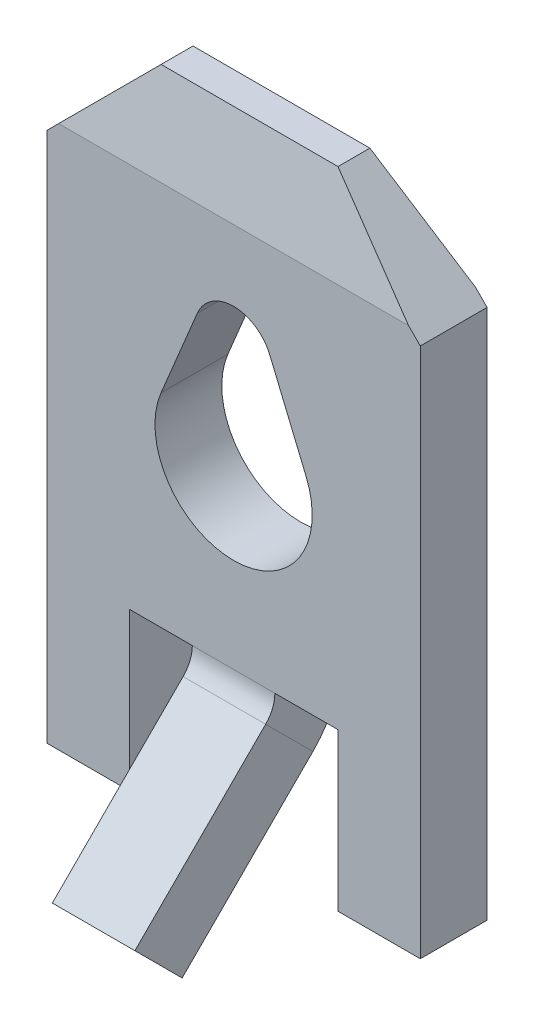
ISO-10303-21;
HEADER;
FILE_DESCRIPTION(('STEP AP214'),'2;1');
FILE_NAME('part.step','',(''),(''),'','','');
FILE_SCHEMA(('AUTOMOTIVE_DESIGN { 1 0 10303 214 1 1 1 1 }'));
ENDSEC;
DATA;
#1=APPLICATION_CONTEXT('core data for automotive mechanical design processes');
#2=APPLICATION_PROTOCOL_DEFINITION('international standard','automotive_design',2000,#1);
#3=PRODUCT_CONTEXT('',#1,'mechanical');
#4=PRODUCT('Part','Part','',(#3));
#5=PRODUCT_RELATED_PRODUCT_CATEGORY('part','',(#4));
#6=PRODUCT_DEFINITION_FORMATION('','',#4);
#7=PRODUCT_DEFINITION_CONTEXT('part definition',#1,'design');
#8=PRODUCT_DEFINITION('design','',#6,#7);
#9=PRODUCT_DEFINITION_SHAPE('','',#8);
#10=(LENGTH_UNIT() NAMED_UNIT(*) SI_UNIT(.MILLI.,.METRE.));
#11=(NAMED_UNIT(*) PLANE_ANGLE_UNIT() SI_UNIT($,.RADIAN.));
#12=(NAMED_UNIT(*) SI_UNIT($,.STERADIAN.) SOLID_ANGLE_UNIT());
#13=UNCERTAINTY_MEASURE_WITH_UNIT(LENGTH_MEASURE(1.E-05),#10,'distance_accuracy_value','');
#14=(GEOMETRIC_REPRESENTATION_CONTEXT(3) GLOBAL_UNCERTAINTY_ASSIGNED_CONTEXT((#13)) GLOBAL_UNIT_ASSIGNED_CONTEXT((#10,
#11,#12)) REPRESENTATION_CONTEXT('',''));
#15=CARTESIAN_POINT('',(0.,0.,0.));
#16=DIRECTION('',(0.,0.,1.));
#17=DIRECTION('',(1.,0.,0.));
#18=AXIS2_PLACEMENT_3D('',#15,#16,#17);
#19=CARTESIAN_POINT('',(4.75,0.149999999999999,0.));
#20=DIRECTION('',(0.,0.,1.));
#21=DIRECTION('',(0.,-1.,0.));
#22=AXIS2_PLACEMENT_3D('',#19,#20,#21);
#23=PLANE('',#22);
#24=DIRECTION('',(0.384813689288076,-0.922994271128754,0.));
#25=VECTOR('',#24,1.);
#26=CARTESIAN_POINT('',(2.84243697464802,5.82748992853653,0.));
#27=LINE('',#26,#25);
#28=CARTESIAN_POINT('',(2.84243697464802,5.82748992853653,0.));
#29=VERTEX_POINT('',#28);
#30=CARTESIAN_POINT('',(3.29799427112875,4.73481368928808,0.));
#31=VERTEX_POINT('',#30);
#32=EDGE_CURVE('E271',#29,#31,#27,.T.);
#33=ORIENTED_EDGE('',*,*,#32,.F.);
#34=CARTESIAN_POINT('',(2.375,5.65,0.));
#35=DIRECTION('',(0.,0.,1.));
#36=DIRECTION('',(0.,-1.,0.));
#37=AXIS2_PLACEMENT_3D('',#34,#35,#36);
#38=CIRCLE('',#37,0.5);
#39=CARTESIAN_POINT('',(1.91346153846154,5.84230769230769,0.));
#40=VERTEX_POINT('',#39);
#41=EDGE_CURVE('E274',#40,#29,#38,.F.);
#42=ORIENTED_EDGE('',*,*,#41,.F.);
#43=DIRECTION('',(0.384615384615385,0.923076923076923,0.));
#44=VECTOR('',#43,1.);
#45=CARTESIAN_POINT('',(1.91346153846154,5.84230769230769,0.));
#46=LINE('',#45,#44);
#47=CARTESIAN_POINT('',(1.45192307692308,4.73461538461538,0.));
#48=VERTEX_POINT('',#47);
#49=EDGE_CURVE('E276',#48,#40,#46,.T.);
#50=ORIENTED_EDGE('',*,*,#49,.F.);
#51=CARTESIAN_POINT('',(2.375,4.35,0.));
#52=DIRECTION('',(0.,0.,1.));
#53=DIRECTION('',(0.,-1.,0.));
#54=AXIS2_PLACEMENT_3D('',#51,#52,#53);
#55=CIRCLE('',#54,1.);
#56=EDGE_CURVE('E268',#31,#48,#55,.F.);
#57=ORIENTED_EDGE('',*,*,#56,.F.);
#58=EDGE_LOOP('',(#33,#42,#50,#57));
#59=FACE_BOUND('',#58,.T.);
#60=DIRECTION('',(1.,0.,0.));
#61=VECTOR('',#60,1.);
#62=CARTESIAN_POINT('',(2.9,2.15,0.));
#63=LINE('',#62,#61);
#64=CARTESIAN_POINT('',(2.9,2.15,0.));
#65=VERTEX_POINT('',#64);
#66=CARTESIAN_POINT('',(3.7,2.15,0.));
#67=VERTEX_POINT('',#66);
#68=EDGE_CURVE('E236',#65,#67,#63,.T.);
#69=ORIENTED_EDGE('',*,*,#68,.F.);
#70=DIRECTION('',(-1.,0.,0.));
#71=VECTOR('',#70,1.);
#72=CARTESIAN_POINT('',(4.75,2.15,0.));
#73=LINE('',#72,#71);
#74=CARTESIAN_POINT('',(1.85000000000001,2.15,0.));
#75=VERTEX_POINT('',#74);
#76=EDGE_CURVE('E49',#65,#75,#73,.T.);
#77=ORIENTED_EDGE('',*,*,#76,.T.);
#78=DIRECTION('',(1.,0.,0.));
#79=VECTOR('',#78,1.);
#80=CARTESIAN_POINT('',(1.85,2.15,0.));
#81=LINE('',#80,#79);
#82=CARTESIAN_POINT('',(1.05,2.15,0.));
#83=VERTEX_POINT('',#82);
#84=EDGE_CURVE('E247',#83,#75,#81,.T.);
#85=ORIENTED_EDGE('',*,*,#84,.F.);
#86=DIRECTION('',(0.,1.,0.));
#87=VECTOR('',#86,1.);
#88=CARTESIAN_POINT('',(1.05,2.15,0.));
#89=LINE('',#88,#87);
#90=CARTESIAN_POINT('',(1.05,0.149999999999999,0.));
#91=VERTEX_POINT('',#90);
#92=EDGE_CURVE('E245',#91,#83,#89,.T.);
#93=ORIENTED_EDGE('',*,*,#92,.F.);
#94=DIRECTION('',(-1.,0.,0.));
#95=VECTOR('',#94,1.);
#96=CARTESIAN_POINT('',(4.75,0.149999999999999,0.));
#97=LINE('',#96,#95);
#98=CARTESIAN_POINT('',(0.,0.149999999999999,0.));
#99=VERTEX_POINT('',#98);
#100=EDGE_CURVE('E345',#91,#99,#97,.T.);
#101=ORIENTED_EDGE('',*,*,#100,.T.);
#102=DIRECTION('',(0.,1.,0.));
#103=VECTOR('',#102,1.);
#104=CARTESIAN_POINT('',(0.,0.149999999999999,0.));
#105=LINE('',#104,#103);
#106=CARTESIAN_POINT('',(0.,6.9,0.));
#107=VERTEX_POINT('',#106);
#108=EDGE_CURVE('E330',#99,#107,#105,.T.);
#109=ORIENTED_EDGE('',*,*,#108,.T.);
#110=DIRECTION('',(-0.707106781186548,-0.707106781186548,0.));
#111=VECTOR('',#110,1.);
#112=CARTESIAN_POINT('',(0.,6.9,0.));
#113=LINE('',#112,#111);
#114=CARTESIAN_POINT('',(0.15,7.05,0.));
#115=VERTEX_POINT('',#114);
#116=EDGE_CURVE('E304',#115,#107,#113,.T.);
#117=ORIENTED_EDGE('',*,*,#116,.F.);
#118=DIRECTION('',(-1.,0.,0.));
#119=VECTOR('',#118,1.);
#120=CARTESIAN_POINT('',(4.75,7.05,0.));
#121=LINE('',#120,#119);
#122=CARTESIAN_POINT('',(4.6,7.05,0.));
#123=VERTEX_POINT('',#122);
#124=EDGE_CURVE('E335',#123,#115,#121,.T.);
#125=ORIENTED_EDGE('',*,*,#124,.F.);
#126=DIRECTION('',(-0.707106781186548,0.707106781186548,0.));
#127=VECTOR('',#126,1.);
#128=CARTESIAN_POINT('',(3.5,8.15,0.));
#129=LINE('',#128,#127);
#130=CARTESIAN_POINT('',(4.75,6.9,0.));
#131=VERTEX_POINT('',#130);
#132=EDGE_CURVE('E300',#131,#123,#129,.T.);
#133=ORIENTED_EDGE('',*,*,#132,.F.);
#134=DIRECTION('',(0.,1.,0.));
#135=VECTOR('',#134,1.);
#136=CARTESIAN_POINT('',(4.75,0.149999999999999,0.));
#137=LINE('',#136,#135);
#138=CARTESIAN_POINT('',(4.75,0.149999999999999,0.));
#139=VERTEX_POINT('',#138);
#140=EDGE_CURVE('E332',#139,#131,#137,.T.);
#141=ORIENTED_EDGE('',*,*,#140,.F.);
#142=CARTESIAN_POINT('',(3.7,0.149999999999999,0.));
#143=VERTEX_POINT('',#142);
#144=EDGE_CURVE('E346',#139,#143,#97,.T.);
#145=ORIENTED_EDGE('',*,*,#144,.T.);
#146=DIRECTION('',(0.,-1.,0.));
#147=VECTOR('',#146,1.);
#148=CARTESIAN_POINT('',(3.7,2.15,0.));
#149=LINE('',#148,#147);
#150=EDGE_CURVE('E260',#67,#143,#149,.T.);
#151=ORIENTED_EDGE('',*,*,#150,.F.);
#152=EDGE_LOOP('',(#69,#77,#85,#93,#101,#109,#117,#125,#133,#141,#145,#151));
#153=FACE_BOUND('',#152,.T.);
#154=ADVANCED_FACE('F42',(#59,#153),#23,.F.);
#155=CARTESIAN_POINT('',(4.75,7.05,0.85));
#156=DIRECTION('',(0.,0.,-1.));
#157=DIRECTION('',(0.,1.,0.));
#158=AXIS2_PLACEMENT_3D('',#155,#156,#157);
#159=PLANE('',#158);
#160=DIRECTION('',(-0.384615384615385,-0.923076923076923,0.));
#161=VECTOR('',#160,1.);
#162=CARTESIAN_POINT('',(1.91346153846154,5.84230769230769,0.849999999999999));
#163=LINE('',#162,#161);
#164=CARTESIAN_POINT('',(1.91346153846154,5.84230769230769,0.85));
#165=VERTEX_POINT('',#164);
#166=CARTESIAN_POINT('',(1.45192307692308,4.73461538461538,0.849999999999999));
#167=VERTEX_POINT('',#166);
#168=EDGE_CURVE('E278',#165,#167,#163,.T.);
#169=ORIENTED_EDGE('',*,*,#168,.F.);
#170=CARTESIAN_POINT('',(2.375,5.65,0.849999999999999));
#171=DIRECTION('',(0.,0.,1.));
#172=DIRECTION('',(1.,0.,0.));
#173=AXIS2_PLACEMENT_3D('',#170,#171,#172);
#174=CIRCLE('',#173,0.5);
#175=CARTESIAN_POINT('',(2.84243697464802,5.82748992853653,0.849999999999999));
#176=VERTEX_POINT('',#175);
#177=EDGE_CURVE('E254',#176,#165,#174,.T.);
#178=ORIENTED_EDGE('',*,*,#177,.F.);
#179=DIRECTION('',(-0.384813689288076,0.922994271128754,0.));
#180=VECTOR('',#179,1.);
#181=CARTESIAN_POINT('',(2.84243697464802,5.82748992853653,0.849999999999999));
#182=LINE('',#181,#180);
#183=CARTESIAN_POINT('',(3.29799427112875,4.73481368928808,0.849999999999999));
#184=VERTEX_POINT('',#183);
#185=EDGE_CURVE('E284',#184,#176,#182,.T.);
#186=ORIENTED_EDGE('',*,*,#185,.F.);
#187=CARTESIAN_POINT('',(2.375,4.35,0.849999999999999));
#188=DIRECTION('',(0.,0.,1.));
#189=DIRECTION('',(1.,0.,0.));
#190=AXIS2_PLACEMENT_3D('',#187,#188,#189);
#191=CIRCLE('',#190,1.);
#192=EDGE_CURVE('E281',#167,#184,#191,.T.);
#193=ORIENTED_EDGE('',*,*,#192,.F.);
#194=EDGE_LOOP('',(#169,#178,#186,#193));
#195=FACE_BOUND('',#194,.T.);
#196=DIRECTION('',(-1.,0.,0.));
#197=VECTOR('',#196,1.);
#198=CARTESIAN_POINT('',(1.85,2.15,0.85));
#199=LINE('',#198,#197);
#200=CARTESIAN_POINT('',(1.85000000000001,2.15,0.849999999999999));
#201=VERTEX_POINT('',#200);
#202=CARTESIAN_POINT('',(1.05,2.15,0.85));
#203=VERTEX_POINT('',#202);
#204=EDGE_CURVE('E241',#201,#203,#199,.T.);
#205=ORIENTED_EDGE('',*,*,#204,.F.);
#206=DIRECTION('',(1.,0.,0.));
#207=VECTOR('',#206,1.);
#208=CARTESIAN_POINT('',(4.75,2.15,0.849999999999999));
#209=LINE('',#208,#207);
#210=CARTESIAN_POINT('',(2.9,2.15,0.849999999999999));
#211=VERTEX_POINT('',#210);
#212=EDGE_CURVE('E362',#201,#211,#209,.T.);
#213=ORIENTED_EDGE('',*,*,#212,.T.);
#214=DIRECTION('',(-1.,0.,0.));
#215=VECTOR('',#214,1.);
#216=CARTESIAN_POINT('',(2.9,2.15,0.85));
#217=LINE('',#216,#215);
#218=CARTESIAN_POINT('',(3.7,2.15,0.85));
#219=VERTEX_POINT('',#218);
#220=EDGE_CURVE('E248',#219,#211,#217,.T.);
#221=ORIENTED_EDGE('',*,*,#220,.F.);
#222=DIRECTION('',(0.,1.,0.));
#223=VECTOR('',#222,1.);
#224=CARTESIAN_POINT('',(3.7,2.15,0.85));
#225=LINE('',#224,#223);
#226=CARTESIAN_POINT('',(3.7,0.149999999999999,0.849999999999999));
#227=VERTEX_POINT('',#226);
#228=EDGE_CURVE('E255',#227,#219,#225,.T.);
#229=ORIENTED_EDGE('',*,*,#228,.F.);
#230=DIRECTION('',(-1.,0.,0.));
#231=VECTOR('',#230,1.);
#232=CARTESIAN_POINT('',(4.75,0.149999999999999,0.849999999999999));
#233=LINE('',#232,#231);
#234=CARTESIAN_POINT('',(4.75,0.149999999999999,0.849999999999999));
#235=VERTEX_POINT('',#234);
#236=EDGE_CURVE('E350',#235,#227,#233,.T.);
#237=ORIENTED_EDGE('',*,*,#236,.F.);
#238=DIRECTION('',(0.,-1.,0.));
#239=VECTOR('',#238,1.);
#240=CARTESIAN_POINT('',(4.75,7.05,0.85));
#241=LINE('',#240,#239);
#242=CARTESIAN_POINT('',(4.75,6.9,0.85));
#243=VERTEX_POINT('',#242);
#244=EDGE_CURVE('E327',#243,#235,#241,.T.);
#245=ORIENTED_EDGE('',*,*,#244,.F.);
#246=DIRECTION('',(0.707106781186548,-0.707106781186548,0.));
#247=VECTOR('',#246,1.);
#248=CARTESIAN_POINT('',(3.5,8.15,0.849999999999999));
#249=LINE('',#248,#247);
#250=CARTESIAN_POINT('',(4.6,7.05,0.849999999999999));
#251=VERTEX_POINT('',#250);
#252=EDGE_CURVE('E296',#251,#243,#249,.T.);
#253=ORIENTED_EDGE('',*,*,#252,.F.);
#254=DIRECTION('',(-1.,0.,0.));
#255=VECTOR('',#254,1.);
#256=CARTESIAN_POINT('',(4.75,7.05,0.85));
#257=LINE('',#256,#255);
#258=CARTESIAN_POINT('',(0.15,7.05,0.849999999999999));
#259=VERTEX_POINT('',#258);
#260=EDGE_CURVE('E353',#251,#259,#257,.T.);
#261=ORIENTED_EDGE('',*,*,#260,.T.);
#262=DIRECTION('',(0.707106781186547,0.707106781186548,0.));
#263=VECTOR('',#262,1.);
#264=CARTESIAN_POINT('',(0.,6.9,0.849999999999999));
#265=LINE('',#264,#263);
#266=CARTESIAN_POINT('',(0.,6.9,0.849999999999999));
#267=VERTEX_POINT('',#266);
#268=EDGE_CURVE('E297',#267,#259,#265,.T.);
#269=ORIENTED_EDGE('',*,*,#268,.F.);
#270=DIRECTION('',(0.,-1.,0.));
#271=VECTOR('',#270,1.);
#272=CARTESIAN_POINT('',(0.,7.05,0.85));
#273=LINE('',#272,#271);
#274=CARTESIAN_POINT('',(0.,0.149999999999999,0.849999999999999));
#275=VERTEX_POINT('',#274);
#276=EDGE_CURVE('E326',#267,#275,#273,.T.);
#277=ORIENTED_EDGE('',*,*,#276,.T.);
#278=CARTESIAN_POINT('',(1.05,0.149999999999999,0.849999999999999));
#279=VERTEX_POINT('',#278);
#280=EDGE_CURVE('E349',#279,#275,#233,.T.);
#281=ORIENTED_EDGE('',*,*,#280,.F.);
#282=DIRECTION('',(0.,-1.,0.));
#283=VECTOR('',#282,1.);
#284=CARTESIAN_POINT('',(1.05,2.15,0.85));
#285=LINE('',#284,#283);
#286=EDGE_CURVE('E243',#203,#279,#285,.T.);
#287=ORIENTED_EDGE('',*,*,#286,.F.);
#288=EDGE_LOOP('',(#205,#213,#221,#229,#237,#245,#253,#261,#269,#277,#281,#287));
#289=FACE_BOUND('',#288,.T.);
#290=ADVANCED_FACE('F382',(#195,#289),#159,.F.);
#291=CARTESIAN_POINT('',(4.75,0.149999999999999,0.));
#292=DIRECTION('',(0.,1.,0.));
#293=DIRECTION('',(0.,0.,1.));
#294=AXIS2_PLACEMENT_3D('',#291,#292,#293);
#295=PLANE('',#294);
#296=ORIENTED_EDGE('',*,*,#100,.F.);
#297=DIRECTION('',(0.,0.,-1.));
#298=VECTOR('',#297,1.);
#299=CARTESIAN_POINT('',(1.05,0.149999999999999,3.0040659228538));
#300=LINE('',#299,#298);
#301=EDGE_CURVE('E63',#279,#91,#300,.T.);
#302=ORIENTED_EDGE('',*,*,#301,.F.);
#303=ORIENTED_EDGE('',*,*,#280,.T.);
#304=DIRECTION('',(0.,0.,-1.));
#305=VECTOR('',#304,1.);
#306=CARTESIAN_POINT('',(0.,0.149999999999999,0.));
#307=LINE('',#306,#305);
#308=EDGE_CURVE('E338',#275,#99,#307,.T.);
#309=ORIENTED_EDGE('',*,*,#308,.T.);
#310=EDGE_LOOP('',(#296,#302,#303,#309));
#311=FACE_BOUND('',#310,.T.);
#312=ADVANCED_FACE('F417',(#311),#295,.F.);
#313=CARTESIAN_POINT('',(4.75,7.05,0.));
#314=DIRECTION('',(0.,-0.214348018272916,0.976757353216485));
#315=DIRECTION('',(0.,-0.976757353216485,-0.214348018272916));
#316=AXIS2_PLACEMENT_3D('',#313,#314,#315);
#317=PLANE('',#316);
#318=ORIENTED_EDGE('',*,*,#124,.T.);
#319=DIRECTION('',(0.698744344369524,0.698744344369524,0.153338457091523));
#320=VECTOR('',#319,1.);
#321=CARTESIAN_POINT('',(2.39592083042662,9.29592083042662,0.492864146468432));
#322=LINE('',#321,#320);
#323=CARTESIAN_POINT('',(1.25,8.15,0.241393442622949));
#324=VERTEX_POINT('',#323);
#325=EDGE_CURVE('E317',#115,#324,#322,.T.);
#326=ORIENTED_EDGE('',*,*,#325,.T.);
#327=DIRECTION('',(-1.,0.,0.));
#328=VECTOR('',#327,1.);
#329=CARTESIAN_POINT('',(4.75,8.15,0.241393442622949));
#330=LINE('',#329,#328);
#331=CARTESIAN_POINT('',(3.5,8.15,0.241393442622949));
#332=VERTEX_POINT('',#331);
#333=EDGE_CURVE('E359',#332,#324,#330,.T.);
#334=ORIENTED_EDGE('',*,*,#333,.F.);
#335=DIRECTION('',(0.698744344369524,-0.698744344369524,-0.153338457091523));
#336=VECTOR('',#335,1.);
#337=CARTESIAN_POINT('',(4.67323654881826,6.97676345118174,-0.0160716569500576));
#338=LINE('',#337,#336);
#339=EDGE_CURVE('E323',#332,#123,#338,.T.);
#340=ORIENTED_EDGE('',*,*,#339,.T.);
#341=EDGE_LOOP('',(#318,#326,#334,#340));
#342=FACE_BOUND('',#341,.T.);
#343=ADVANCED_FACE('F479',(#342),#317,.F.);
#344=CARTESIAN_POINT('',(4.75,8.15,0.241393442622949));
#345=DIRECTION('',(0.,-1.,0.));
#346=DIRECTION('',(0.,0.,-1.));
#347=AXIS2_PLACEMENT_3D('',#344,#345,#346);
#348=PLANE('',#347);
#349=ORIENTED_EDGE('',*,*,#333,.T.);
#350=DIRECTION('',(0.,0.,1.));
#351=VECTOR('',#350,1.);
#352=CARTESIAN_POINT('',(1.25,8.15,-1.76776695296637));
#353=LINE('',#352,#351);
#354=CARTESIAN_POINT('',(1.25,8.15,0.647131147540979));
#355=VERTEX_POINT('',#354);
#356=EDGE_CURVE('E301',#324,#355,#353,.T.);
#357=ORIENTED_EDGE('',*,*,#356,.T.);
#358=DIRECTION('',(-1.,0.,0.));
#359=VECTOR('',#358,1.);
#360=CARTESIAN_POINT('',(4.75,8.15,0.647131147540979));
#361=LINE('',#360,#359);
#362=CARTESIAN_POINT('',(3.5,8.15,0.647131147540979));
#363=VERTEX_POINT('',#362);
#364=EDGE_CURVE('E356',#363,#355,#361,.T.);
#365=ORIENTED_EDGE('',*,*,#364,.F.);
#366=DIRECTION('',(0.,0.,1.));
#367=VECTOR('',#366,1.);
#368=CARTESIAN_POINT('',(3.5,8.15,-1.76776695296637));
#369=LINE('',#368,#367);
#370=EDGE_CURVE('E309',#332,#363,#369,.T.);
#371=ORIENTED_EDGE('',*,*,#370,.F.);
#372=EDGE_LOOP('',(#349,#357,#365,#371));
#373=FACE_BOUND('',#372,.T.);
#374=ADVANCED_FACE('F475',(#373),#348,.F.);
#375=CARTESIAN_POINT('',(4.75,8.15,0.647131147540979));
#376=DIRECTION('',(0.,-0.181367589437408,-0.983415373838371));
#377=DIRECTION('',(0.,0.983415373838371,-0.181367589437408));
#378=AXIS2_PLACEMENT_3D('',#375,#376,#377);
#379=PLANE('',#378);
#380=ORIENTED_EDGE('',*,*,#364,.T.);
#381=DIRECTION('',(-0.70116968993079,-0.70116968993079,0.12931408215937));
#382=VECTOR('',#381,1.);
#383=CARTESIAN_POINT('',(2.97073626927174,9.87073626927174,0.329782245421185));
#384=LINE('',#383,#382);
#385=EDGE_CURVE('E307',#355,#259,#384,.T.);
#386=ORIENTED_EDGE('',*,*,#385,.T.);
#387=ORIENTED_EDGE('',*,*,#260,.F.);
#388=DIRECTION('',(-0.70116968993079,0.70116968993079,-0.12931408215937));
#389=VECTOR('',#388,1.);
#390=CARTESIAN_POINT('',(4.11454866759705,7.53545133240295,0.760470041155192));
#391=LINE('',#390,#389);
#392=EDGE_CURVE('E320',#251,#363,#391,.T.);
#393=ORIENTED_EDGE('',*,*,#392,.T.);
#394=EDGE_LOOP('',(#380,#386,#387,#393));
#395=FACE_BOUND('',#394,.T.);
#396=ADVANCED_FACE('F471',(#395),#379,.F.);
#397=ORIENTED_EDGE('',*,*,#236,.T.);
#398=DIRECTION('',(0.,0.,-1.));
#399=VECTOR('',#398,1.);
#400=CARTESIAN_POINT('',(3.7,0.149999999999999,3.0040659228538));
#401=LINE('',#400,#399);
#402=EDGE_CURVE('E257',#227,#143,#401,.T.);
#403=ORIENTED_EDGE('',*,*,#402,.T.);
#404=ORIENTED_EDGE('',*,*,#144,.F.);
#405=DIRECTION('',(0.,0.,-1.));
#406=VECTOR('',#405,1.);
#407=CARTESIAN_POINT('',(4.75,0.149999999999999,0.));
#408=LINE('',#407,#406);
#409=EDGE_CURVE('E329',#235,#139,#408,.T.);
#410=ORIENTED_EDGE('',*,*,#409,.F.);
#411=EDGE_LOOP('',(#397,#403,#404,#410));
#412=FACE_BOUND('',#411,.T.);
#413=ADVANCED_FACE('F464',(#412),#295,.F.);
#414=CARTESIAN_POINT('',(4.75,0.,0.));
#415=DIRECTION('',(1.,0.,0.));
#416=DIRECTION('',(0.,0.,-1.));
#417=AXIS2_PLACEMENT_3D('',#414,#415,#416);
#418=PLANE('',#417);
#419=DIRECTION('',(0.,0.,1.));
#420=VECTOR('',#419,1.);
#421=CARTESIAN_POINT('',(4.75,6.9,-1.76776695296637));
#422=LINE('',#421,#420);
#423=EDGE_CURVE('E310',#131,#243,#422,.T.);
#424=ORIENTED_EDGE('',*,*,#423,.T.);
#425=ORIENTED_EDGE('',*,*,#244,.T.);
#426=ORIENTED_EDGE('',*,*,#409,.T.);
#427=ORIENTED_EDGE('',*,*,#140,.T.);
#428=EDGE_LOOP('',(#424,#425,#426,#427));
#429=FACE_BOUND('',#428,.T.);
#430=ADVANCED_FACE('F461',(#429),#418,.T.);
#431=CARTESIAN_POINT('',(0.,0.,0.));
#432=DIRECTION('',(1.,0.,0.));
#433=DIRECTION('',(0.,0.,-1.));
#434=AXIS2_PLACEMENT_3D('',#431,#432,#433);
#435=PLANE('',#434);
#436=ORIENTED_EDGE('',*,*,#276,.F.);
#437=DIRECTION('',(0.,0.,1.));
#438=VECTOR('',#437,1.);
#439=CARTESIAN_POINT('',(0.,6.9,-1.76776695296637));
#440=LINE('',#439,#438);
#441=EDGE_CURVE('E299',#107,#267,#440,.T.);
#442=ORIENTED_EDGE('',*,*,#441,.F.);
#443=ORIENTED_EDGE('',*,*,#108,.F.);
#444=ORIENTED_EDGE('',*,*,#308,.F.);
#445=EDGE_LOOP('',(#436,#442,#443,#444));
#446=FACE_BOUND('',#445,.T.);
#447=ADVANCED_FACE('F456',(#446),#435,.F.);
#448=CARTESIAN_POINT('',(0.,6.9,-1.76776695296637));
#449=DIRECTION('',(0.707106781186548,-0.707106781186548,0.));
#450=DIRECTION('',(0.707106781186548,0.707106781186548,0.));
#451=AXIS2_PLACEMENT_3D('',#448,#449,#450);
#452=PLANE('',#451);
#453=ORIENTED_EDGE('',*,*,#116,.T.);
#454=ORIENTED_EDGE('',*,*,#441,.T.);
#455=ORIENTED_EDGE('',*,*,#268,.T.);
#456=ORIENTED_EDGE('',*,*,#385,.F.);
#457=ORIENTED_EDGE('',*,*,#356,.F.);
#458=ORIENTED_EDGE('',*,*,#325,.F.);
#459=EDGE_LOOP('',(#453,#454,#455,#456,#457,#458));
#460=FACE_BOUND('',#459,.T.);
#461=ADVANCED_FACE('F453',(#460),#452,.F.);
#462=CARTESIAN_POINT('',(3.5,8.15,-1.76776695296637));
#463=DIRECTION('',(-0.707106781186547,-0.707106781186547,0.));
#464=DIRECTION('',(0.707106781186548,-0.707106781186548,0.));
#465=AXIS2_PLACEMENT_3D('',#462,#463,#464);
#466=PLANE('',#465);
#467=ORIENTED_EDGE('',*,*,#370,.T.);
#468=ORIENTED_EDGE('',*,*,#392,.F.);
#469=ORIENTED_EDGE('',*,*,#252,.T.);
#470=ORIENTED_EDGE('',*,*,#423,.F.);
#471=ORIENTED_EDGE('',*,*,#132,.T.);
#472=ORIENTED_EDGE('',*,*,#339,.F.);
#473=EDGE_LOOP('',(#467,#468,#469,#470,#471,#472));
#474=FACE_BOUND('',#473,.T.);
#475=ADVANCED_FACE('F452',(#474),#466,.F.);
#476=CARTESIAN_POINT('',(2.375,5.65,-3.44093010681705));
#477=DIRECTION('',(0.,0.,1.));
#478=DIRECTION('',(1.,0.,0.));
#479=AXIS2_PLACEMENT_3D('',#476,#477,#478);
#480=CYLINDRICAL_SURFACE('',#479,0.5);
#481=ORIENTED_EDGE('',*,*,#41,.T.);
#482=DIRECTION('',(0.,0.,1.));
#483=VECTOR('',#482,1.);
#484=CARTESIAN_POINT('',(2.84243697464802,5.82748992853653,-3.44093010681705));
#485=LINE('',#484,#483);
#486=EDGE_CURVE('E272',#29,#176,#485,.T.);
#487=ORIENTED_EDGE('',*,*,#486,.T.);
#488=ORIENTED_EDGE('',*,*,#177,.T.);
#489=DIRECTION('',(0.,0.,1.));
#490=VECTOR('',#489,1.);
#491=CARTESIAN_POINT('',(1.91346153846154,5.84230769230769,-3.44093010681705));
#492=LINE('',#491,#490);
#493=EDGE_CURVE('E287',#40,#165,#492,.T.);
#494=ORIENTED_EDGE('',*,*,#493,.F.);
#495=EDGE_LOOP('',(#481,#487,#488,#494));
#496=FACE_BOUND('',#495,.T.);
#497=ADVANCED_FACE('F435',(#496),#480,.F.);
#498=CARTESIAN_POINT('',(2.84243697464802,5.82748992853653,-3.44093010681705));
#499=DIRECTION('',(0.922994271128754,0.384813689288076,0.));
#500=DIRECTION('',(-0.384813689288076,0.922994271128754,0.));
#501=AXIS2_PLACEMENT_3D('',#498,#499,#500);
#502=PLANE('',#501);
#503=ORIENTED_EDGE('',*,*,#32,.T.);
#504=DIRECTION('',(0.,0.,1.));
#505=VECTOR('',#504,1.);
#506=CARTESIAN_POINT('',(3.29799427112875,4.73481368928808,-3.44093010681705));
#507=LINE('',#506,#505);
#508=EDGE_CURVE('E289',#31,#184,#507,.T.);
#509=ORIENTED_EDGE('',*,*,#508,.T.);
#510=ORIENTED_EDGE('',*,*,#185,.T.);
#511=ORIENTED_EDGE('',*,*,#486,.F.);
#512=EDGE_LOOP('',(#503,#509,#510,#511));
#513=FACE_BOUND('',#512,.T.);
#514=ADVANCED_FACE('F426',(#513),#502,.F.);
#515=CARTESIAN_POINT('',(2.375,4.35,-3.44093010681705));
#516=DIRECTION('',(0.,0.,1.));
#517=DIRECTION('',(1.,0.,0.));
#518=AXIS2_PLACEMENT_3D('',#515,#516,#517);
#519=CYLINDRICAL_SURFACE('',#518,1.);
#520=ORIENTED_EDGE('',*,*,#56,.T.);
#521=DIRECTION('',(0.,0.,1.));
#522=VECTOR('',#521,1.);
#523=CARTESIAN_POINT('',(1.45192307692308,4.73461538461538,-3.44093010681705));
#524=LINE('',#523,#522);
#525=EDGE_CURVE('E291',#48,#167,#524,.T.);
#526=ORIENTED_EDGE('',*,*,#525,.T.);
#527=ORIENTED_EDGE('',*,*,#192,.T.);
#528=ORIENTED_EDGE('',*,*,#508,.F.);
#529=EDGE_LOOP('',(#520,#526,#527,#528));
#530=FACE_BOUND('',#529,.T.);
#531=ADVANCED_FACE('F428',(#530),#519,.F.);
#532=CARTESIAN_POINT('',(1.91346153846154,5.84230769230769,-3.44093010681705));
#533=DIRECTION('',(-0.923076923076923,0.384615384615385,0.));
#534=DIRECTION('',(-0.384615384615385,-0.923076923076923,0.));
#535=AXIS2_PLACEMENT_3D('',#532,#533,#534);
#536=PLANE('',#535);
#537=ORIENTED_EDGE('',*,*,#49,.T.);
#538=ORIENTED_EDGE('',*,*,#493,.T.);
#539=ORIENTED_EDGE('',*,*,#168,.T.);
#540=ORIENTED_EDGE('',*,*,#525,.F.);
#541=EDGE_LOOP('',(#537,#538,#539,#540));
#542=FACE_BOUND('',#541,.T.);
#543=ADVANCED_FACE('F437',(#542),#536,.F.);
#544=CARTESIAN_POINT('',(3.7,2.15,3.0040659228538));
#545=DIRECTION('',(1.,0.,0.));
#546=DIRECTION('',(0.,1.,0.));
#547=AXIS2_PLACEMENT_3D('',#544,#545,#546);
#548=PLANE('',#547);
#549=ORIENTED_EDGE('',*,*,#228,.T.);
#550=DIRECTION('',(0.,0.,-1.));
#551=VECTOR('',#550,1.);
#552=CARTESIAN_POINT('',(3.7,2.15,3.0040659228538));
#553=LINE('',#552,#551);
#554=EDGE_CURVE('E262',#219,#67,#553,.T.);
#555=ORIENTED_EDGE('',*,*,#554,.T.);
#556=ORIENTED_EDGE('',*,*,#150,.T.);
#557=ORIENTED_EDGE('',*,*,#402,.F.);
#558=EDGE_LOOP('',(#549,#555,#556,#557));
#559=FACE_BOUND('',#558,.T.);
#560=ADVANCED_FACE('F439',(#559),#548,.F.);
#561=CARTESIAN_POINT('',(2.9,2.15,3.0040659228538));
#562=DIRECTION('',(0.,1.,0.));
#563=DIRECTION('',(-1.,0.,0.));
#564=AXIS2_PLACEMENT_3D('',#561,#562,#563);
#565=PLANE('',#564);
#566=ORIENTED_EDGE('',*,*,#220,.T.);
#567=DIRECTION('',(0.,0.,-1.));
#568=VECTOR('',#567,1.);
#569=CARTESIAN_POINT('',(2.9,2.15,3.0040659228538));
#570=LINE('',#569,#568);
#571=EDGE_CURVE('E12',#211,#65,#570,.T.);
#572=ORIENTED_EDGE('',*,*,#571,.T.);
#573=ORIENTED_EDGE('',*,*,#68,.T.);
#574=ORIENTED_EDGE('',*,*,#554,.F.);
#575=EDGE_LOOP('',(#566,#572,#573,#574));
#576=FACE_BOUND('',#575,.T.);
#577=ADVANCED_FACE('F372',(#576),#565,.F.);
#578=CARTESIAN_POINT('',(1.85,2.15,3.0040659228538));
#579=DIRECTION('',(0.,1.,0.));
#580=DIRECTION('',(0.,0.,1.));
#581=AXIS2_PLACEMENT_3D('',#578,#579,#580);
#582=PLANE('',#581);
#583=ORIENTED_EDGE('',*,*,#204,.T.);
#584=DIRECTION('',(0.,0.,-1.));
#585=VECTOR('',#584,1.);
#586=CARTESIAN_POINT('',(1.05,2.15,3.0040659228538));
#587=LINE('',#586,#585);
#588=EDGE_CURVE('E244',#203,#83,#587,.T.);
#589=ORIENTED_EDGE('',*,*,#588,.T.);
#590=ORIENTED_EDGE('',*,*,#84,.T.);
#591=DIRECTION('',(0.,0.,-1.));
#592=VECTOR('',#591,1.);
#593=CARTESIAN_POINT('',(1.85,2.15,3.0040659228538));
#594=LINE('',#593,#592);
#595=EDGE_CURVE('E365',#201,#75,#594,.T.);
#596=ORIENTED_EDGE('',*,*,#595,.F.);
#597=EDGE_LOOP('',(#583,#589,#590,#596));
#598=FACE_BOUND('',#597,.T.);
#599=ADVANCED_FACE('F389',(#598),#582,.F.);
#600=CARTESIAN_POINT('',(1.05,2.15,3.0040659228538));
#601=DIRECTION('',(-1.,0.,0.));
#602=DIRECTION('',(0.,-1.,0.));
#603=AXIS2_PLACEMENT_3D('',#600,#601,#602);
#604=PLANE('',#603);
#605=ORIENTED_EDGE('',*,*,#286,.T.);
#606=ORIENTED_EDGE('',*,*,#301,.T.);
#607=ORIENTED_EDGE('',*,*,#92,.T.);
#608=ORIENTED_EDGE('',*,*,#588,.F.);
#609=EDGE_LOOP('',(#605,#606,#607,#608));
#610=FACE_BOUND('',#609,.T.);
#611=ADVANCED_FACE('F506',(#610),#604,.F.);
#612=CARTESIAN_POINT('',(1.85,2.15,1.25));
#613=DIRECTION('',(1.,0.,0.));
#614=DIRECTION('',(0.,1.,0.));
#615=AXIS2_PLACEMENT_3D('',#612,#613,#614);
#616=PLANE('',#615);
#617=ORIENTED_EDGE('',*,*,#595,.T.);
#618=CARTESIAN_POINT('',(1.85000000000001,2.15,1.25));
#619=DIRECTION('',(1.,0.,0.));
#620=DIRECTION('',(0.,1.,0.));
#621=AXIS2_PLACEMENT_3D('',#618,#619,#620);
#622=CIRCLE('',#621,1.25);
#623=CARTESIAN_POINT('',(1.85,1.26611652351682,0.366116523516817));
#624=VERTEX_POINT('',#623);
#625=EDGE_CURVE('E238',#75,#624,#622,.F.);
#626=ORIENTED_EDGE('',*,*,#625,.T.);
#627=DIRECTION('',(0.,0.707106781186544,0.707106781186551));
#628=VECTOR('',#627,1.);
#629=CARTESIAN_POINT('',(1.85,3.39031190869815,2.49031190869817));
#630=LINE('',#629,#628);
#631=CARTESIAN_POINT('',(1.85,1.86715728752538,0.967157287525381));
#632=VERTEX_POINT('',#631);
#633=EDGE_CURVE('E217',#624,#632,#630,.T.);
#634=ORIENTED_EDGE('',*,*,#633,.T.);
#635=CARTESIAN_POINT('',(1.85,2.15,1.25));
#636=DIRECTION('',(-1.,0.,0.));
#637=DIRECTION('',(0.,1.,0.));
#638=AXIS2_PLACEMENT_3D('',#635,#636,#637);
#639=CIRCLE('',#638,0.4);
#640=EDGE_CURVE('E229',#201,#632,#639,.T.);
#641=ORIENTED_EDGE('',*,*,#640,.F.);
#642=EDGE_LOOP('',(#617,#626,#634,#641));
#643=FACE_BOUND('',#642,.T.);
#644=ADVANCED_FACE('F391',(#643),#616,.F.);
#645=CARTESIAN_POINT('',(2.9,2.15,1.25));
#646=DIRECTION('',(-1.,0.,0.));
#647=DIRECTION('',(0.,0.,1.));
#648=AXIS2_PLACEMENT_3D('',#645,#646,#647);
#649=PLANE('',#648);
#650=DIRECTION('',(0.,-0.707106781186544,-0.707106781186551));
#651=VECTOR('',#650,1.);
#652=CARTESIAN_POINT('',(2.9,3.39031190869815,2.49031190869817));
#653=LINE('',#652,#651);
#654=CARTESIAN_POINT('',(2.9,1.86715728752538,0.96715728752538));
#655=VERTEX_POINT('',#654);
#656=CARTESIAN_POINT('',(2.9,1.26611652351682,0.366116523516817));
#657=VERTEX_POINT('',#656);
#658=EDGE_CURVE('E198',#655,#657,#653,.T.);
#659=ORIENTED_EDGE('',*,*,#658,.T.);
#660=CARTESIAN_POINT('',(2.9,2.15,1.25));
#661=DIRECTION('',(1.,0.,0.));
#662=DIRECTION('',(0.,1.,0.));
#663=AXIS2_PLACEMENT_3D('',#660,#661,#662);
#664=CIRCLE('',#663,1.25);
#665=EDGE_CURVE('E233',#657,#65,#664,.T.);
#666=ORIENTED_EDGE('',*,*,#665,.T.);
#667=ORIENTED_EDGE('',*,*,#571,.F.);
#668=CARTESIAN_POINT('',(2.9,2.15,1.25));
#669=DIRECTION('',(1.,0.,0.));
#670=DIRECTION('',(0.,0.,1.));
#671=AXIS2_PLACEMENT_3D('',#668,#669,#670);
#672=CIRCLE('',#671,0.4);
#673=EDGE_CURVE('E232',#655,#211,#672,.T.);
#674=ORIENTED_EDGE('',*,*,#673,.F.);
#675=EDGE_LOOP('',(#659,#666,#667,#674));
#676=FACE_BOUND('',#675,.T.);
#677=ADVANCED_FACE('F376',(#676),#649,.F.);
#678=CARTESIAN_POINT('',(0.876719746353102,2.15,1.25));
#679=DIRECTION('',(1.,0.,0.));
#680=DIRECTION('',(0.,1.,0.));
#681=AXIS2_PLACEMENT_3D('',#678,#679,#680);
#682=CYLINDRICAL_SURFACE('',#681,0.4);
#683=ORIENTED_EDGE('',*,*,#673,.T.);
#684=ORIENTED_EDGE('',*,*,#212,.F.);
#685=ORIENTED_EDGE('',*,*,#640,.T.);
#686=DIRECTION('',(1.,0.,0.));
#687=VECTOR('',#686,1.);
#688=CARTESIAN_POINT('',(4.75,1.86715728752538,0.967157287525383));
#689=LINE('',#688,#687);
#690=EDGE_CURVE('E227',#632,#655,#689,.T.);
#691=ORIENTED_EDGE('',*,*,#690,.T.);
#692=EDGE_LOOP('',(#683,#684,#685,#691));
#693=FACE_BOUND('',#692,.T.);
#694=ADVANCED_FACE('F379',(#693),#682,.F.);
#695=CARTESIAN_POINT('',(0.876719746353102,2.15,1.25));
#696=DIRECTION('',(1.,0.,0.));
#697=DIRECTION('',(0.,1.,0.));
#698=AXIS2_PLACEMENT_3D('',#695,#696,#697);
#699=CYLINDRICAL_SURFACE('',#698,1.25);
#700=ORIENTED_EDGE('',*,*,#665,.F.);
#701=DIRECTION('',(-1.,0.,0.));
#702=VECTOR('',#701,1.);
#703=CARTESIAN_POINT('',(4.75,1.26611652351682,0.366116523516814));
#704=LINE('',#703,#702);
#705=EDGE_CURVE('E220',#657,#624,#704,.T.);
#706=ORIENTED_EDGE('',*,*,#705,.T.);
#707=ORIENTED_EDGE('',*,*,#625,.F.);
#708=ORIENTED_EDGE('',*,*,#76,.F.);
#709=EDGE_LOOP('',(#700,#706,#707,#708));
#710=FACE_BOUND('',#709,.T.);
#711=ADVANCED_FACE('F392',(#710),#699,.T.);
#712=CARTESIAN_POINT('',(0.,-0.397031517045243,2.02926456407888));
#713=DIRECTION('',(0.,-0.707106781186546,0.707106781186549));
#714=DIRECTION('',(0.,-0.707106781186549,-0.707106781186546));
#715=AXIS2_PLACEMENT_3D('',#712,#713,#714);
#716=PLANE('',#715);
#717=DIRECTION('',(0.,0.707106781186549,0.707106781186546));
#718=VECTOR('',#717,1.);
#719=CARTESIAN_POINT('',(2.9,-0.397031517045244,2.02926456407888));
#720=LINE('',#719,#718);
#721=CARTESIAN_POINT('',(2.9,-0.397031517045244,2.02926456407888));
#722=VERTEX_POINT('',#721);
#723=CARTESIAN_POINT('',(2.9,0.204009246963322,2.63030532808745));
#724=VERTEX_POINT('',#723);
#725=EDGE_CURVE('E196',#722,#724,#720,.T.);
#726=ORIENTED_EDGE('',*,*,#725,.T.);
#727=DIRECTION('',(-1.,0.,0.));
#728=VECTOR('',#727,1.);
#729=CARTESIAN_POINT('',(2.9,0.204009246963322,2.63030532808745));
#730=LINE('',#729,#728);
#731=CARTESIAN_POINT('',(1.85,0.204009246963323,2.63030532808745));
#732=VERTEX_POINT('',#731);
#733=EDGE_CURVE('E205',#724,#732,#730,.T.);
#734=ORIENTED_EDGE('',*,*,#733,.T.);
#735=DIRECTION('',(0.,-0.707106781186549,-0.707106781186546));
#736=VECTOR('',#735,1.);
#737=CARTESIAN_POINT('',(1.85,0.204009246963323,2.63030532808745));
#738=LINE('',#737,#736);
#739=CARTESIAN_POINT('',(1.85,-0.397031517045243,2.02926456407888));
#740=VERTEX_POINT('',#739);
#741=EDGE_CURVE('E211',#732,#740,#738,.T.);
#742=ORIENTED_EDGE('',*,*,#741,.T.);
#743=DIRECTION('',(1.,0.,0.));
#744=VECTOR('',#743,1.);
#745=CARTESIAN_POINT('',(1.85,-0.397031517045243,2.02926456407888));
#746=LINE('',#745,#744);
#747=EDGE_CURVE('E216',#740,#722,#746,.T.);
#748=ORIENTED_EDGE('',*,*,#747,.T.);
#749=EDGE_LOOP('',(#726,#734,#742,#748));
#750=FACE_BOUND('',#749,.T.);
#751=ADVANCED_FACE('F214',(#750),#716,.T.);
#752=CARTESIAN_POINT('',(4.75,5.79015281833704,-2.95583824328629));
#753=DIRECTION('',(0.,-0.707106781186549,-0.707106781186546));
#754=DIRECTION('',(0.,0.707106781186546,-0.707106781186549));
#755=AXIS2_PLACEMENT_3D('',#752,#753,#754);
#756=PLANE('',#755);
#757=ORIENTED_EDGE('',*,*,#690,.F.);
#758=DIRECTION('',(0.,0.707106781186546,-0.707106781186549));
#759=VECTOR('',#758,1.);
#760=CARTESIAN_POINT('',(1.85,2.32532959052296,0.508984984527799));
#761=LINE('',#760,#759);
#762=EDGE_CURVE('E202',#732,#632,#761,.T.);
#763=ORIENTED_EDGE('',*,*,#762,.F.);
#764=ORIENTED_EDGE('',*,*,#733,.F.);
#765=DIRECTION('',(0.,-0.707106781186546,0.707106781186549));
#766=VECTOR('',#765,1.);
#767=CARTESIAN_POINT('',(2.9,2.32532959052296,0.508984984527799));
#768=LINE('',#767,#766);
#769=EDGE_CURVE('E192',#655,#724,#768,.T.);
#770=ORIENTED_EDGE('',*,*,#769,.F.);
#771=EDGE_LOOP('',(#757,#763,#764,#770));
#772=FACE_BOUND('',#771,.T.);
#773=ADVANCED_FACE('F206',(#772),#756,.F.);
#774=CARTESIAN_POINT('',(1.85,3.84848421169575,2.03213960570058));
#775=DIRECTION('',(1.,0.,0.));
#776=DIRECTION('',(0.,0.707106781186546,-0.707106781186549));
#777=AXIS2_PLACEMENT_3D('',#774,#775,#776);
#778=PLANE('',#777);
#779=ORIENTED_EDGE('',*,*,#633,.F.);
#780=DIRECTION('',(0.,-0.707106781186546,0.707106781186549));
#781=VECTOR('',#780,1.);
#782=CARTESIAN_POINT('',(1.85,1.7242888265144,-0.0920557794807644));
#783=LINE('',#782,#781);
#784=EDGE_CURVE('E396',#624,#740,#783,.T.);
#785=ORIENTED_EDGE('',*,*,#784,.T.);
#786=ORIENTED_EDGE('',*,*,#741,.F.);
#787=ORIENTED_EDGE('',*,*,#762,.T.);
#788=EDGE_LOOP('',(#779,#785,#786,#787));
#789=FACE_BOUND('',#788,.T.);
#790=ADVANCED_FACE('F400',(#789),#778,.F.);
#791=CARTESIAN_POINT('',(4.75,0.310075264141302,1.32215778289233));
#792=DIRECTION('',(0.,0.707106781186549,0.707106781186546));
#793=DIRECTION('',(0.,-0.707106781186546,0.707106781186549));
#794=AXIS2_PLACEMENT_3D('',#791,#792,#793);
#795=PLANE('',#794);
#796=ORIENTED_EDGE('',*,*,#705,.F.);
#797=DIRECTION('',(0.,0.707106781186546,-0.707106781186549));
#798=VECTOR('',#797,1.);
#799=CARTESIAN_POINT('',(2.9,1.7242888265144,-0.0920557794807646));
#800=LINE('',#799,#798);
#801=EDGE_CURVE('E201',#722,#657,#800,.T.);
#802=ORIENTED_EDGE('',*,*,#801,.F.);
#803=ORIENTED_EDGE('',*,*,#747,.F.);
#804=ORIENTED_EDGE('',*,*,#784,.F.);
#805=EDGE_LOOP('',(#796,#802,#803,#804));
#806=FACE_BOUND('',#805,.T.);
#807=ADVANCED_FACE('F395',(#806),#795,.F.);
#808=CARTESIAN_POINT('',(2.9,3.84848421169575,2.03213960570058));
#809=DIRECTION('',(-1.,0.,0.));
#810=DIRECTION('',(0.,-0.707106781186546,0.707106781186549));
#811=AXIS2_PLACEMENT_3D('',#808,#809,#810);
#812=PLANE('',#811);
#813=ORIENTED_EDGE('',*,*,#658,.F.);
#814=ORIENTED_EDGE('',*,*,#769,.T.);
#815=ORIENTED_EDGE('',*,*,#725,.F.);
#816=ORIENTED_EDGE('',*,*,#801,.T.);
#817=EDGE_LOOP('',(#813,#814,#815,#816));
#818=FACE_BOUND('',#817,.T.);
#819=ADVANCED_FACE('F194',(#818),#812,.F.);
#820=CLOSED_SHELL('',(#154,#290,#312,#343,#374,#396,#413,#430,#447,#461,#475,#497,#514,#531,
#543,#560,#577,#599,#611,#644,#677,#694,#711,#751,#773,#790,#807,#819));
#821=MANIFOLD_SOLID_BREP('B2',#820);
#822=ADVANCED_BREP_SHAPE_REPRESENTATION('',(#18,#821),#14);
#823=SHAPE_DEFINITION_REPRESENTATION(#9,#822);
ENDSEC;
END-ISO-10303-21;
